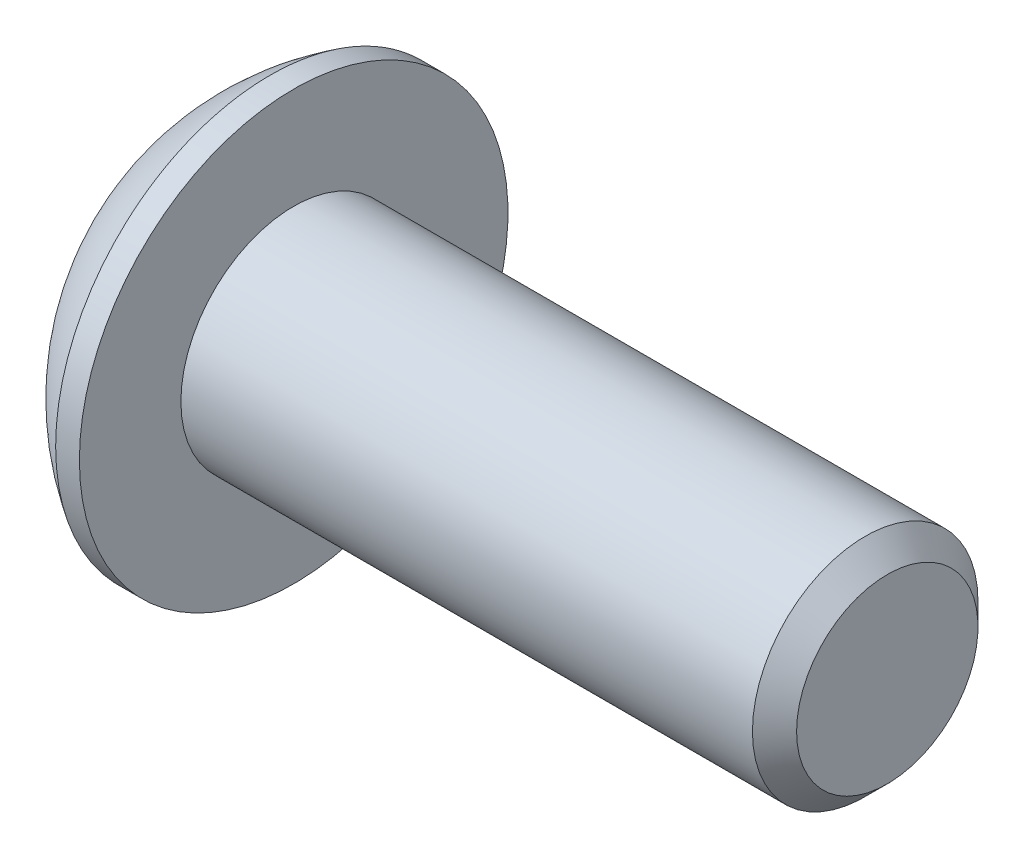
ISO-10303-21;
HEADER;
FILE_DESCRIPTION(('STEP AP214'),'2;1');
FILE_NAME('part.step','',(''),(''),'','','');
FILE_SCHEMA(('AUTOMOTIVE_DESIGN { 1 0 10303 214 1 1 1 1 }'));
ENDSEC;
DATA;
#1=APPLICATION_CONTEXT('core data for automotive mechanical design processes');
#2=APPLICATION_PROTOCOL_DEFINITION('international standard','automotive_design',2000,#1);
#3=PRODUCT_CONTEXT('',#1,'mechanical');
#4=PRODUCT('Part','Part','',(#3));
#5=PRODUCT_RELATED_PRODUCT_CATEGORY('part','',(#4));
#6=PRODUCT_DEFINITION_FORMATION('','',#4);
#7=PRODUCT_DEFINITION_CONTEXT('part definition',#1,'design');
#8=PRODUCT_DEFINITION('design','',#6,#7);
#9=PRODUCT_DEFINITION_SHAPE('','',#8);
#10=(LENGTH_UNIT() NAMED_UNIT(*) SI_UNIT(.MILLI.,.METRE.));
#11=(NAMED_UNIT(*) PLANE_ANGLE_UNIT() SI_UNIT($,.RADIAN.));
#12=(NAMED_UNIT(*) SI_UNIT($,.STERADIAN.) SOLID_ANGLE_UNIT());
#13=UNCERTAINTY_MEASURE_WITH_UNIT(LENGTH_MEASURE(1.E-05),#10,'distance_accuracy_value','');
#14=(GEOMETRIC_REPRESENTATION_CONTEXT(3) GLOBAL_UNCERTAINTY_ASSIGNED_CONTEXT((#13)) GLOBAL_UNIT_ASSIGNED_CONTEXT((#10,
#11,#12)) REPRESENTATION_CONTEXT('',''));
#15=CARTESIAN_POINT('',(0.,0.,0.));
#16=DIRECTION('',(0.,0.,1.));
#17=DIRECTION('',(1.,0.,0.));
#18=AXIS2_PLACEMENT_3D('',#15,#16,#17);
#19=CARTESIAN_POINT('',(1.77800000000017,0.,0.));
#20=DIRECTION('',(-1.,0.,0.));
#21=DIRECTION('',(0.,0.,1.));
#22=AXIS2_PLACEMENT_3D('',#19,#20,#21);
#23=CONICAL_SURFACE('',#22,1.58749999999985,1.04719755119662);
#24=CARTESIAN_POINT('',(2.69454355233856,0.,0.));
#25=VERTEX_POINT('',#24);
#26=VERTEX_LOOP('',#25);
#27=FACE_BOUND('',#26,.T.);
#28=CARTESIAN_POINT('',(1.77800000000017,0.,0.));
#29=DIRECTION('',(-1.,0.,0.));
#30=DIRECTION('',(0.,0.,1.));
#31=AXIS2_PLACEMENT_3D('',#28,#29,#30);
#32=CIRCLE('',#31,1.58749999999985);
#33=CARTESIAN_POINT('',(1.77800000000008,0.,1.58749999999993));
#34=VERTEX_POINT('',#33);
#35=CARTESIAN_POINT('',(1.77800000000008,-1.37481532850773,0.793749999999962));
#36=VERTEX_POINT('',#35);
#37=EDGE_CURVE('E20',#34,#36,#32,.F.);
#38=ORIENTED_EDGE('',*,*,#37,.F.);
#39=CARTESIAN_POINT('',(1.77800000000017,0.,0.));
#40=DIRECTION('',(-1.,0.,0.));
#41=DIRECTION('',(0.,0.,1.));
#42=AXIS2_PLACEMENT_3D('',#39,#40,#41);
#43=CIRCLE('',#42,1.58749999999985);
#44=CARTESIAN_POINT('',(1.77800000000008,1.37481532850773,0.793749999999964));
#45=VERTEX_POINT('',#44);
#46=EDGE_CURVE('E90',#34,#45,#43,.T.);
#47=ORIENTED_EDGE('',*,*,#46,.T.);
#48=CARTESIAN_POINT('',(1.77800000000017,0.,0.));
#49=DIRECTION('',(-1.,0.,0.));
#50=DIRECTION('',(0.,0.,1.));
#51=AXIS2_PLACEMENT_3D('',#48,#49,#50);
#52=CIRCLE('',#51,1.58749999999985);
#53=CARTESIAN_POINT('',(1.77800000000008,1.37481532850773,-0.793749999999964));
#54=VERTEX_POINT('',#53);
#55=EDGE_CURVE('E106',#45,#54,#52,.T.);
#56=ORIENTED_EDGE('',*,*,#55,.T.);
#57=CARTESIAN_POINT('',(1.77800000000017,0.,0.));
#58=DIRECTION('',(-1.,0.,0.));
#59=DIRECTION('',(0.,0.,1.));
#60=AXIS2_PLACEMENT_3D('',#57,#58,#59);
#61=CIRCLE('',#60,1.58749999999985);
#62=CARTESIAN_POINT('',(1.77800000000008,2.13833679173112E-12,-1.58749999999993));
#63=VERTEX_POINT('',#62);
#64=EDGE_CURVE('E449',#54,#63,#61,.T.);
#65=ORIENTED_EDGE('',*,*,#64,.T.);
#66=CARTESIAN_POINT('',(1.77800000000017,0.,0.));
#67=DIRECTION('',(-1.,0.,0.));
#68=DIRECTION('',(0.,0.,1.));
#69=AXIS2_PLACEMENT_3D('',#66,#67,#68);
#70=CIRCLE('',#69,1.58749999999985);
#71=CARTESIAN_POINT('',(1.77800000000008,-1.37481532850773,-0.793749999999963));
#72=VERTEX_POINT('',#71);
#73=EDGE_CURVE('E451',#72,#63,#70,.F.);
#74=ORIENTED_EDGE('',*,*,#73,.F.);
#75=CARTESIAN_POINT('',(1.77800000000017,0.,0.));
#76=DIRECTION('',(-1.,0.,0.));
#77=DIRECTION('',(0.,0.,1.));
#78=AXIS2_PLACEMENT_3D('',#75,#76,#77);
#79=CIRCLE('',#78,1.58749999999985);
#80=EDGE_CURVE('E93',#36,#72,#79,.F.);
#81=ORIENTED_EDGE('',*,*,#80,.F.);
#82=EDGE_LOOP('',(#38,#47,#56,#65,#74,#81));
#83=FACE_BOUND('',#82,.T.);
#84=ADVANCED_FACE('F17',(#27,#83),#23,.F.);
#85=CARTESIAN_POINT('',(1.778,-2.74963065701559,-1.5875));
#86=DIRECTION('',(1.,0.,0.));
#87=DIRECTION('',(0.,0.,-1.));
#88=AXIS2_PLACEMENT_3D('',#85,#86,#87);
#89=PLANE('',#88);
#90=DIRECTION('',(0.,0.5,0.866025403784439));
#91=VECTOR('',#90,1.);
#92=CARTESIAN_POINT('',(1.778,-1.83308710467706,0.));
#93=LINE('',#92,#91);
#94=CARTESIAN_POINT('',(1.778,-0.916543552338531,1.5875));
#95=VERTEX_POINT('',#94);
#96=EDGE_CURVE('E111',#95,#36,#93,.F.);
#97=ORIENTED_EDGE('',*,*,#96,.F.);
#98=DIRECTION('',(0.,1.,0.));
#99=VECTOR('',#98,1.);
#100=CARTESIAN_POINT('',(1.778,-0.916543552338531,1.5875));
#101=LINE('',#100,#99);
#102=EDGE_CURVE('E109',#34,#95,#101,.F.);
#103=ORIENTED_EDGE('',*,*,#102,.F.);
#104=ORIENTED_EDGE('',*,*,#37,.T.);
#105=EDGE_LOOP('',(#97,#103,#104));
#106=FACE_BOUND('',#105,.T.);
#107=ADVANCED_FACE('F110',(#106),#89,.F.);
#108=CARTESIAN_POINT('',(1.778,-2.74963065701559,-1.5875));
#109=DIRECTION('',(1.,0.,0.));
#110=DIRECTION('',(0.,0.,-1.));
#111=AXIS2_PLACEMENT_3D('',#108,#109,#110);
#112=PLANE('',#111);
#113=DIRECTION('',(0.,-0.5,0.866025403784439));
#114=VECTOR('',#113,1.);
#115=CARTESIAN_POINT('',(1.778,-0.916543552338531,-1.5875));
#116=LINE('',#115,#114);
#117=CARTESIAN_POINT('',(1.778,-1.83308710467706,0.));
#118=VERTEX_POINT('',#117);
#119=EDGE_CURVE('E159',#118,#72,#116,.F.);
#120=ORIENTED_EDGE('',*,*,#119,.F.);
#121=DIRECTION('',(0.,0.5,0.866025403784439));
#122=VECTOR('',#121,1.);
#123=CARTESIAN_POINT('',(1.778,-1.83308710467706,0.));
#124=LINE('',#123,#122);
#125=EDGE_CURVE('E171',#36,#118,#124,.F.);
#126=ORIENTED_EDGE('',*,*,#125,.F.);
#127=ORIENTED_EDGE('',*,*,#80,.T.);
#128=EDGE_LOOP('',(#120,#126,#127));
#129=FACE_BOUND('',#128,.T.);
#130=ADVANCED_FACE('F248',(#129),#112,.F.);
#131=CARTESIAN_POINT('',(1.778,-2.74963065701559,-1.5875));
#132=DIRECTION('',(1.,0.,0.));
#133=DIRECTION('',(0.,0.,-1.));
#134=AXIS2_PLACEMENT_3D('',#131,#132,#133);
#135=PLANE('',#134);
#136=DIRECTION('',(0.,1.,0.));
#137=VECTOR('',#136,1.);
#138=CARTESIAN_POINT('',(1.778,0.916543552338531,-1.5875));
#139=LINE('',#138,#137);
#140=CARTESIAN_POINT('',(1.778,-0.916543552338531,-1.5875));
#141=VERTEX_POINT('',#140);
#142=EDGE_CURVE('E143',#141,#63,#139,.T.);
#143=ORIENTED_EDGE('',*,*,#142,.F.);
#144=DIRECTION('',(0.,-0.5,0.866025403784439));
#145=VECTOR('',#144,1.);
#146=CARTESIAN_POINT('',(1.778,-0.916543552338531,-1.5875));
#147=LINE('',#146,#145);
#148=EDGE_CURVE('E156',#72,#141,#147,.F.);
#149=ORIENTED_EDGE('',*,*,#148,.F.);
#150=ORIENTED_EDGE('',*,*,#73,.T.);
#151=EDGE_LOOP('',(#143,#149,#150));
#152=FACE_BOUND('',#151,.T.);
#153=ADVANCED_FACE('F244',(#152),#135,.F.);
#154=CARTESIAN_POINT('',(1.778,-2.74963065701559,-1.5875));
#155=DIRECTION('',(1.,0.,0.));
#156=DIRECTION('',(0.,0.,-1.));
#157=AXIS2_PLACEMENT_3D('',#154,#155,#156);
#158=PLANE('',#157);
#159=DIRECTION('',(0.,-0.500000000000001,-0.866025403784438));
#160=VECTOR('',#159,1.);
#161=CARTESIAN_POINT('',(1.778,1.83308710467706,0.));
#162=LINE('',#161,#160);
#163=CARTESIAN_POINT('',(1.778,0.91654355233853,-1.5875));
#164=VERTEX_POINT('',#163);
#165=EDGE_CURVE('E128',#164,#54,#162,.F.);
#166=ORIENTED_EDGE('',*,*,#165,.F.);
#167=DIRECTION('',(0.,1.,0.));
#168=VECTOR('',#167,1.);
#169=CARTESIAN_POINT('',(1.778,0.916543552338531,-1.5875));
#170=LINE('',#169,#168);
#171=EDGE_CURVE('E140',#63,#164,#170,.T.);
#172=ORIENTED_EDGE('',*,*,#171,.F.);
#173=ORIENTED_EDGE('',*,*,#64,.F.);
#174=EDGE_LOOP('',(#166,#172,#173));
#175=FACE_BOUND('',#174,.T.);
#176=ADVANCED_FACE('F240',(#175),#158,.F.);
#177=CARTESIAN_POINT('',(1.778,-2.74963065701559,-1.5875));
#178=DIRECTION('',(1.,0.,0.));
#179=DIRECTION('',(0.,0.,-1.));
#180=AXIS2_PLACEMENT_3D('',#177,#178,#179);
#181=PLANE('',#180);
#182=DIRECTION('',(0.,0.5,-0.866025403784438));
#183=VECTOR('',#182,1.);
#184=CARTESIAN_POINT('',(1.778,0.916543552338531,1.5875));
#185=LINE('',#184,#183);
#186=CARTESIAN_POINT('',(1.778,1.83308710467706,0.));
#187=VERTEX_POINT('',#186);
#188=EDGE_CURVE('E148',#187,#45,#185,.F.);
#189=ORIENTED_EDGE('',*,*,#188,.F.);
#190=DIRECTION('',(0.,-0.500000000000001,-0.866025403784438));
#191=VECTOR('',#190,1.);
#192=CARTESIAN_POINT('',(1.778,1.83308710467706,0.));
#193=LINE('',#192,#191);
#194=EDGE_CURVE('E125',#54,#187,#193,.F.);
#195=ORIENTED_EDGE('',*,*,#194,.F.);
#196=ORIENTED_EDGE('',*,*,#55,.F.);
#197=EDGE_LOOP('',(#189,#195,#196));
#198=FACE_BOUND('',#197,.T.);
#199=ADVANCED_FACE('F237',(#198),#181,.F.);
#200=CARTESIAN_POINT('',(1.778,-2.74963065701559,-1.5875));
#201=DIRECTION('',(1.,0.,0.));
#202=DIRECTION('',(0.,0.,-1.));
#203=AXIS2_PLACEMENT_3D('',#200,#201,#202);
#204=PLANE('',#203);
#205=DIRECTION('',(0.,1.,0.));
#206=VECTOR('',#205,1.);
#207=CARTESIAN_POINT('',(1.778,-0.916543552338531,1.5875));
#208=LINE('',#207,#206);
#209=CARTESIAN_POINT('',(1.778,0.916543552338531,1.5875));
#210=VERTEX_POINT('',#209);
#211=EDGE_CURVE('E101',#210,#34,#208,.F.);
#212=ORIENTED_EDGE('',*,*,#211,.F.);
#213=DIRECTION('',(0.,0.5,-0.866025403784438));
#214=VECTOR('',#213,1.);
#215=CARTESIAN_POINT('',(1.778,0.916543552338531,1.5875));
#216=LINE('',#215,#214);
#217=EDGE_CURVE('E104',#45,#210,#216,.F.);
#218=ORIENTED_EDGE('',*,*,#217,.F.);
#219=ORIENTED_EDGE('',*,*,#46,.F.);
#220=EDGE_LOOP('',(#212,#218,#219));
#221=FACE_BOUND('',#220,.T.);
#222=ADVANCED_FACE('F99',(#221),#204,.F.);
#223=CARTESIAN_POINT('',(1.778,-0.916543552338531,1.5875));
#224=DIRECTION('',(0.,0.,-1.));
#225=DIRECTION('',(0.,1.,0.));
#226=AXIS2_PLACEMENT_3D('',#223,#224,#225);
#227=PLANE('',#226);
#228=DIRECTION('',(0.,1.,0.));
#229=VECTOR('',#228,1.);
#230=CARTESIAN_POINT('',(0.,0.,1.5875));
#231=LINE('',#230,#229);
#232=CARTESIAN_POINT('',(0.,0.916543552338531,1.5875));
#233=VERTEX_POINT('',#232);
#234=CARTESIAN_POINT('',(0.,-0.916543552338531,1.5875));
#235=VERTEX_POINT('',#234);
#236=EDGE_CURVE('E132',#233,#235,#231,.F.);
#237=ORIENTED_EDGE('',*,*,#236,.F.);
#238=DIRECTION('',(1.,0.,0.));
#239=VECTOR('',#238,1.);
#240=CARTESIAN_POINT('',(1.778,0.916543552338531,1.5875));
#241=LINE('',#240,#239);
#242=EDGE_CURVE('E117',#210,#233,#241,.F.);
#243=ORIENTED_EDGE('',*,*,#242,.F.);
#244=ORIENTED_EDGE('',*,*,#211,.T.);
#245=ORIENTED_EDGE('',*,*,#102,.T.);
#246=DIRECTION('',(1.,0.,0.));
#247=VECTOR('',#246,1.);
#248=CARTESIAN_POINT('',(1.778,-0.916543552338531,1.5875));
#249=LINE('',#248,#247);
#250=EDGE_CURVE('E168',#235,#95,#249,.T.);
#251=ORIENTED_EDGE('',*,*,#250,.F.);
#252=EDGE_LOOP('',(#237,#243,#244,#245,#251));
#253=FACE_BOUND('',#252,.T.);
#254=ADVANCED_FACE('F115',(#253),#227,.T.);
#255=CARTESIAN_POINT('',(1.778,-1.83308710467706,0.));
#256=DIRECTION('',(0.,0.866025403784439,-0.5));
#257=DIRECTION('',(0.,0.5,0.866025403784439));
#258=AXIS2_PLACEMENT_3D('',#255,#256,#257);
#259=PLANE('',#258);
#260=DIRECTION('',(0.,-0.5,-0.866025403784439));
#261=VECTOR('',#260,1.);
#262=CARTESIAN_POINT('',(0.,-0.916543552338531,1.5875));
#263=LINE('',#262,#261);
#264=CARTESIAN_POINT('',(0.,-1.83308710467706,0.));
#265=VERTEX_POINT('',#264);
#266=EDGE_CURVE('E435',#235,#265,#263,.T.);
#267=ORIENTED_EDGE('',*,*,#266,.F.);
#268=ORIENTED_EDGE('',*,*,#250,.T.);
#269=ORIENTED_EDGE('',*,*,#96,.T.);
#270=ORIENTED_EDGE('',*,*,#125,.T.);
#271=DIRECTION('',(1.,0.,0.));
#272=VECTOR('',#271,1.);
#273=CARTESIAN_POINT('',(1.778,-1.83308710467706,0.));
#274=LINE('',#273,#272);
#275=EDGE_CURVE('E153',#265,#118,#274,.T.);
#276=ORIENTED_EDGE('',*,*,#275,.F.);
#277=EDGE_LOOP('',(#267,#268,#269,#270,#276));
#278=FACE_BOUND('',#277,.T.);
#279=ADVANCED_FACE('F228',(#278),#259,.T.);
#280=CARTESIAN_POINT('',(1.778,-0.916543552338531,-1.5875));
#281=DIRECTION('',(0.,0.866025403784439,0.5));
#282=DIRECTION('',(0.,-0.5,0.866025403784439));
#283=AXIS2_PLACEMENT_3D('',#280,#281,#282);
#284=PLANE('',#283);
#285=DIRECTION('',(0.,0.5,-0.866025403784439));
#286=VECTOR('',#285,1.);
#287=CARTESIAN_POINT('',(0.,-1.83308710467706,0.));
#288=LINE('',#287,#286);
#289=CARTESIAN_POINT('',(0.,-0.916543552338531,-1.5875));
#290=VERTEX_POINT('',#289);
#291=EDGE_CURVE('E432',#265,#290,#288,.T.);
#292=ORIENTED_EDGE('',*,*,#291,.F.);
#293=ORIENTED_EDGE('',*,*,#275,.T.);
#294=ORIENTED_EDGE('',*,*,#119,.T.);
#295=ORIENTED_EDGE('',*,*,#148,.T.);
#296=DIRECTION('',(1.,0.,0.));
#297=VECTOR('',#296,1.);
#298=CARTESIAN_POINT('',(1.778,-0.916543552338531,-1.5875));
#299=LINE('',#298,#297);
#300=EDGE_CURVE('E137',#290,#141,#299,.T.);
#301=ORIENTED_EDGE('',*,*,#300,.F.);
#302=EDGE_LOOP('',(#292,#293,#294,#295,#301));
#303=FACE_BOUND('',#302,.T.);
#304=ADVANCED_FACE('F224',(#303),#284,.T.);
#305=CARTESIAN_POINT('',(1.778,0.916543552338531,-1.5875));
#306=DIRECTION('',(0.,0.,1.));
#307=DIRECTION('',(1.,0.,0.));
#308=AXIS2_PLACEMENT_3D('',#305,#306,#307);
#309=PLANE('',#308);
#310=DIRECTION('',(0.,1.,0.));
#311=VECTOR('',#310,1.);
#312=CARTESIAN_POINT('',(0.,0.,-1.5875));
#313=LINE('',#312,#311);
#314=CARTESIAN_POINT('',(0.,0.91654355233853,-1.5875));
#315=VERTEX_POINT('',#314);
#316=EDGE_CURVE('E429',#290,#315,#313,.T.);
#317=ORIENTED_EDGE('',*,*,#316,.F.);
#318=ORIENTED_EDGE('',*,*,#300,.T.);
#319=ORIENTED_EDGE('',*,*,#142,.T.);
#320=ORIENTED_EDGE('',*,*,#171,.T.);
#321=DIRECTION('',(1.,0.,0.));
#322=VECTOR('',#321,1.);
#323=CARTESIAN_POINT('',(1.778,0.91654355233853,-1.5875));
#324=LINE('',#323,#322);
#325=EDGE_CURVE('E127',#315,#164,#324,.T.);
#326=ORIENTED_EDGE('',*,*,#325,.F.);
#327=EDGE_LOOP('',(#317,#318,#319,#320,#326));
#328=FACE_BOUND('',#327,.T.);
#329=ADVANCED_FACE('F221',(#328),#309,.T.);
#330=CARTESIAN_POINT('',(1.778,1.83308710467706,0.));
#331=DIRECTION('',(0.,-0.866025403784438,0.500000000000001));
#332=DIRECTION('',(0.,-0.500000000000001,-0.866025403784438));
#333=AXIS2_PLACEMENT_3D('',#330,#331,#332);
#334=PLANE('',#333);
#335=DIRECTION('',(0.,0.500000000000001,0.866025403784438));
#336=VECTOR('',#335,1.);
#337=CARTESIAN_POINT('',(0.,0.916543552338531,-1.5875));
#338=LINE('',#337,#336);
#339=CARTESIAN_POINT('',(0.,1.83308710467706,0.));
#340=VERTEX_POINT('',#339);
#341=EDGE_CURVE('E426',#315,#340,#338,.T.);
#342=ORIENTED_EDGE('',*,*,#341,.F.);
#343=ORIENTED_EDGE('',*,*,#325,.T.);
#344=ORIENTED_EDGE('',*,*,#165,.T.);
#345=ORIENTED_EDGE('',*,*,#194,.T.);
#346=DIRECTION('',(1.,0.,0.));
#347=VECTOR('',#346,1.);
#348=CARTESIAN_POINT('',(1.778,1.83308710467706,0.));
#349=LINE('',#348,#347);
#350=EDGE_CURVE('E35',#340,#187,#349,.T.);
#351=ORIENTED_EDGE('',*,*,#350,.F.);
#352=EDGE_LOOP('',(#342,#343,#344,#345,#351));
#353=FACE_BOUND('',#352,.T.);
#354=ADVANCED_FACE('F217',(#353),#334,.T.);
#355=CARTESIAN_POINT('',(1.778,0.916543552338531,1.5875));
#356=DIRECTION('',(0.,-0.866025403784438,-0.5));
#357=DIRECTION('',(0.,0.5,-0.866025403784438));
#358=AXIS2_PLACEMENT_3D('',#355,#356,#357);
#359=PLANE('',#358);
#360=DIRECTION('',(0.,-0.5,0.866025403784438));
#361=VECTOR('',#360,1.);
#362=CARTESIAN_POINT('',(0.,1.83308710467706,0.));
#363=LINE('',#362,#361);
#364=EDGE_CURVE('E203',#340,#233,#363,.T.);
#365=ORIENTED_EDGE('',*,*,#364,.F.);
#366=ORIENTED_EDGE('',*,*,#350,.T.);
#367=ORIENTED_EDGE('',*,*,#188,.T.);
#368=ORIENTED_EDGE('',*,*,#217,.T.);
#369=ORIENTED_EDGE('',*,*,#242,.T.);
#370=EDGE_LOOP('',(#365,#366,#367,#368,#369));
#371=FACE_BOUND('',#370,.T.);
#372=ADVANCED_FACE('F213',(#371),#359,.T.);
#373=CARTESIAN_POINT('',(0.,0.,0.));
#374=DIRECTION('',(-1.,0.,0.));
#375=DIRECTION('',(0.,0.,1.));
#376=AXIS2_PLACEMENT_3D('',#373,#374,#375);
#377=PLANE('',#376);
#378=ORIENTED_EDGE('',*,*,#341,.T.);
#379=ORIENTED_EDGE('',*,*,#364,.T.);
#380=ORIENTED_EDGE('',*,*,#236,.T.);
#381=ORIENTED_EDGE('',*,*,#266,.T.);
#382=ORIENTED_EDGE('',*,*,#291,.T.);
#383=ORIENTED_EDGE('',*,*,#316,.T.);
#384=EDGE_LOOP('',(#378,#379,#380,#381,#382,#383));
#385=FACE_BOUND('',#384,.T.);
#386=CARTESIAN_POINT('',(0.,2.29235,0.));
#387=CARTESIAN_POINT('',(0.,2.29234961429956,0.0643619991867153));
#388=CARTESIAN_POINT('',(0.,2.28963695190107,0.128735826629365));
#389=CARTESIAN_POINT('',(0.,2.27880393843647,0.257038618985285));
#390=CARTESIAN_POINT('',(0.,2.27068199085126,0.320967446929161));
#391=CARTESIAN_POINT('',(0.,2.24906694794255,0.448021254607715));
#392=CARTESIAN_POINT('',(-2.10824184437212E-13,2.2355653265346,0.511144793381859));
#393=CARTESIAN_POINT('',(2.11863340668574E-13,2.20328400495643,0.636065176149319));
#394=CARTESIAN_POINT('',(7.898583416728E-13,2.18450002159113,0.697860899533932));
#395=CARTESIAN_POINT('',(1.31296954862567E-12,2.12048422735802,0.880329802927745));
#396=CARTESIAN_POINT('',(0.,2.06753599079458,0.998391795928112));
#397=CARTESIAN_POINT('',(0.,1.94254204858672,1.22393765942147));
#398=CARTESIAN_POINT('',(1.09188685833251E-12,1.87049561696642,1.33142112758208));
#399=CARTESIAN_POINT('',(6.7685541846695E-13,1.7497425419488,1.48237719670934));
#400=CARTESIAN_POINT('',(1.81629011781581E-13,1.707345731323,1.53101280076737));
#401=CARTESIAN_POINT('',(-1.80586950453791E-13,1.61863910291528,1.62450601319185));
#402=CARTESIAN_POINT('',(0.,1.57233309727312,1.66936721890417));
#403=CARTESIAN_POINT('',(0.,1.47608431707233,1.7550488420402));
#404=CARTESIAN_POINT('',(0.,1.42613990458994,1.79586741981511));
#405=CARTESIAN_POINT('',(0.,1.3229945254125,1.87315615311522));
#406=CARTESIAN_POINT('',(0.,1.26979280714187,1.90962529930696));
#407=CARTESIAN_POINT('',(0.,1.10588180153952,2.01207722151089));
#408=CARTESIAN_POINT('',(0.,0.990764947001308,2.07119486286666));
#409=CARTESIAN_POINT('',(0.,0.752302198839715,2.16922858468856));
#410=CARTESIAN_POINT('',(0.,0.628956393121258,2.20814488091449));
#411=CARTESIAN_POINT('',(0.,0.377466101733267,2.26472755765919));
#412=CARTESIAN_POINT('',(0.,0.249321590440378,2.28239382469378));
#413=CARTESIAN_POINT('',(0.,-0.00811435371610919,2.29595665980955));
#414=CARTESIAN_POINT('',(0.,-0.137405786579707,2.29185322789072));
#415=CARTESIAN_POINT('',(0.,-0.393449386933728,2.2620096240906));
#416=CARTESIAN_POINT('',(0.,-0.520201567981086,2.23626956775766));
#417=CARTESIAN_POINT('',(0.,-0.767645294384453,2.16383549332687));
#418=CARTESIAN_POINT('',(0.,-0.888336774993558,2.11714125142685));
#419=CARTESIAN_POINT('',(0.,-1.06210572146656,2.03247976453653));
#420=CARTESIAN_POINT('',(0.,-1.11884498714067,2.00180278323695));
#421=CARTESIAN_POINT('',(0.,-1.22954062855573,1.93578011658035));
#422=CARTESIAN_POINT('',(0.,-1.28349764565393,1.9004355139425));
#423=CARTESIAN_POINT('',(0.,-1.38821676641538,1.82534174602348));
#424=CARTESIAN_POINT('',(0.,-1.43898030563029,1.78559458231503));
#425=CARTESIAN_POINT('',(0.,-1.53701984534431,1.70193996292361));
#426=CARTESIAN_POINT('',(0.,-1.58429243280551,1.65802852924126));
#427=CARTESIAN_POINT('',(0.,-1.72023903553758,1.52059650554138));
#428=CARTESIAN_POINT('',(0.,-1.80318066138239,1.42127847626519));
#429=CARTESIAN_POINT('',(0.,-1.95118232345099,1.21011519784664));
#430=CARTESIAN_POINT('',(0.,-2.01624303935585,1.09827042509272));
#431=CARTESIAN_POINT('',(0.,-2.09907772661315,0.92353823800584));
#432=CARTESIAN_POINT('',(0.,-2.12425103063559,0.864058373981967));
#433=CARTESIAN_POINT('',(0.,-2.16947990046566,0.743221562175602));
#434=CARTESIAN_POINT('',(0.,-2.18953960800684,0.681866178863367));
#435=CARTESIAN_POINT('',(0.,-2.22438542051156,0.55778697240036));
#436=CARTESIAN_POINT('',(0.,-2.23917985294819,0.495065478128176));
#437=CARTESIAN_POINT('',(0.,-2.26343456384454,0.368611258323519));
#438=CARTESIAN_POINT('',(0.,-2.27289641559286,0.304878836759572));
#439=CARTESIAN_POINT('',(0.,-2.28388649696737,0.200873029360627));
#440=CARTESIAN_POINT('',(0.,-2.28705930623294,0.1607661641801));
#441=CARTESIAN_POINT('',(0.,-2.29129117827045,0.0804410725432722));
#442=CARTESIAN_POINT('',(0.,-2.29235024104239,0.0402228460869721));
#443=CARTESIAN_POINT('',(0.,-2.29234961429957,-0.0643619991867166));
#444=CARTESIAN_POINT('',(0.,-2.28963695190108,-0.128735826629366));
#445=CARTESIAN_POINT('',(0.,-2.27880393843648,-0.257038618985286));
#446=CARTESIAN_POINT('',(0.,-2.27068199085127,-0.320967446929162));
#447=CARTESIAN_POINT('',(0.,-2.24906694794256,-0.448021254607716));
#448=CARTESIAN_POINT('',(-2.10791682211012E-13,-2.23556532653461,-0.51114479338186));
#449=CARTESIAN_POINT('',(2.11830812011626E-13,-2.20328400495644,-0.63606517614932));
#450=CARTESIAN_POINT('',(7.89900352979323E-13,-2.18450002159114,-0.697860899533933));
#451=CARTESIAN_POINT('',(1.31288572627556E-12,-2.12048422735803,-0.880329802927746));
#452=CARTESIAN_POINT('',(0.,-2.06753599079459,-0.998391795928114));
#453=CARTESIAN_POINT('',(0.,-1.94254204858673,-1.22393765942147));
#454=CARTESIAN_POINT('',(1.09432969402769E-12,-1.87049561696643,-1.33142112758208));
#455=CARTESIAN_POINT('',(6.78235621887555E-13,-1.74974254194881,-1.48237719670935));
#456=CARTESIAN_POINT('',(1.82023220003121E-13,-1.70734573132301,-1.53101280076737));
#457=CARTESIAN_POINT('',(-1.80980778599231E-13,-1.61863910291529,-1.62450601319185));
#458=CARTESIAN_POINT('',(0.,-1.57233309727313,-1.66936721890417));
#459=CARTESIAN_POINT('',(0.,-1.47608431707234,-1.7550488420402));
#460=CARTESIAN_POINT('',(0.,-1.42613990458995,-1.79586741981511));
#461=CARTESIAN_POINT('',(0.,-1.32299452541251,-1.87315615311522));
#462=CARTESIAN_POINT('',(0.,-1.26979280714188,-1.90962529930696));
#463=CARTESIAN_POINT('',(0.,-1.10588180153953,-2.01207722151089));
#464=CARTESIAN_POINT('',(0.,-0.990764947001315,-2.07119486286666));
#465=CARTESIAN_POINT('',(0.,-0.752302198839722,-2.16922858468855));
#466=CARTESIAN_POINT('',(0.,-0.628956393121265,-2.20814488091449));
#467=CARTESIAN_POINT('',(0.,-0.377466101733275,-2.26472755765919));
#468=CARTESIAN_POINT('',(0.,-0.249321590440386,-2.28239382469378));
#469=CARTESIAN_POINT('',(0.,0.00811435371609967,-2.29595665980955));
#470=CARTESIAN_POINT('',(0.,0.137405786579697,-2.29185322789072));
#471=CARTESIAN_POINT('',(0.,0.393449386933717,-2.2620096240906));
#472=CARTESIAN_POINT('',(0.,0.520201567981075,-2.23626956775766));
#473=CARTESIAN_POINT('',(0.,0.767645294384443,-2.16383549332687));
#474=CARTESIAN_POINT('',(0.,0.888336774993549,-2.11714125142686));
#475=CARTESIAN_POINT('',(0.,1.06210572146655,-2.03247976453654));
#476=CARTESIAN_POINT('',(0.,1.11884498714066,-2.00180278323695));
#477=CARTESIAN_POINT('',(0.,1.22954062855572,-1.93578011658035));
#478=CARTESIAN_POINT('',(0.,1.28349764565392,-1.9004355139425));
#479=CARTESIAN_POINT('',(0.,1.38821676641537,-1.82534174602348));
#480=CARTESIAN_POINT('',(0.,1.43898030563028,-1.78559458231503));
#481=CARTESIAN_POINT('',(0.,1.53701984534431,-1.70193996292362));
#482=CARTESIAN_POINT('',(0.,1.5842924328055,-1.65802852924127));
#483=CARTESIAN_POINT('',(0.,1.72023903553758,-1.52059650554139));
#484=CARTESIAN_POINT('',(0.,1.80318066138238,-1.42127847626519));
#485=CARTESIAN_POINT('',(0.,1.95118232345098,-1.21011519784664));
#486=CARTESIAN_POINT('',(0.,2.01624303935584,-1.09827042509272));
#487=CARTESIAN_POINT('',(0.,2.09907772661314,-0.923538238005841));
#488=CARTESIAN_POINT('',(0.,2.12425103063558,-0.864058373981969));
#489=CARTESIAN_POINT('',(0.,2.16947990046565,-0.743221562175604));
#490=CARTESIAN_POINT('',(0.,2.18953960800683,-0.681866178863368));
#491=CARTESIAN_POINT('',(0.,2.22438542051155,-0.55778697240036));
#492=CARTESIAN_POINT('',(0.,2.23917985294818,-0.495065478128176));
#493=CARTESIAN_POINT('',(0.,2.26343456384453,-0.368611258323519));
#494=CARTESIAN_POINT('',(0.,2.27289641559285,-0.304878836759573));
#495=CARTESIAN_POINT('',(0.,2.28388649696736,-0.200873029360628));
#496=CARTESIAN_POINT('',(0.,2.28705930623293,-0.160766164180101));
#497=CARTESIAN_POINT('',(0.,2.29129117827044,-0.0804410725432734));
#498=CARTESIAN_POINT('',(0.,2.29235024104238,-0.0402228460869733));
#499=CARTESIAN_POINT('',(0.,2.29235,0.));
#500=B_SPLINE_CURVE_WITH_KNOTS('',3,(#386,#387,#388,#389,#390,#391,#392,#393,#394,#395,#396,
#397,#398,#399,#400,#401,#402,#403,#404,#405,#406,#407,#408,#409,#410,#411,#412,#413,#414,#415,
#416,#417,#418,#419,#420,#421,#422,#423,#424,#425,#426,#427,#428,#429,#430,#431,#432,#433,#434,
#435,#436,#437,#438,#439,#440,#441,#442,#443,#444,#445,#446,#447,#448,#449,#450,#451,#452,#453,
#454,#455,#456,#457,#458,#459,#460,#461,#462,#463,#464,#465,#466,#467,#468,#469,#470,#471,#472,
#473,#474,#475,#476,#477,#478,#479,#480,#481,#482,#483,#484,#485,#486,#487,#488,#489,#490,#491,
#492,#493,#494,#495,#496,#497,#498,#499),.UNSPECIFIED.,.T.,.F.,(4,2,2,2,2,2,2,2,2,2,2,2,2,2,2,2,
2,2,2,2,2,2,2,2,2,2,2,2,2,2,2,2,2,2,2,2,2,2,2,2,2,2,2,2,2,2,2,2,2,2,2,2,2,2,2,2,4),(0.,
0.193048968618032,0.386154939782393,0.579568183995957,0.773138711491036,1.15935703864577,
1.54559004914644,1.73895960916368,1.93214273180063,2.12541336477221,2.31872876140888,
2.70495649282618,3.09118009906582,3.47740576789431,3.86363143672284,4.24985504296253,
4.63608277437979,4.82939817101619,5.02266880398747,5.21585192662419,5.40922148664121,
5.79545449714216,6.18167282429724,6.3752433517926,6.5686565960064,6.76176256717088,
6.95481153578907,7.07545693291921,7.19610233004936,7.38915129866739,7.58225726983176,
7.77567051404532,7.9692410415404,8.35545936869513,8.74169237919581,8.93506193921304,
9.12824506184999,9.32151569482157,9.51483109145824,9.90105882287554,10.2872824291152,
10.6735080979437,11.0597337667722,11.4459573730119,11.8321851044291,12.0255005010656,
12.2187711340368,12.4119542566736,12.6053238166906,12.9915568271915,13.3777751543466,
13.571345681842,13.7647589260558,13.9578648972202,14.1509138658384,14.2715592629686,
14.3922046600987),.UNSPECIFIED.);
#501=CARTESIAN_POINT('',(0.,2.29235,0.));
#502=VERTEX_POINT('',#501);
#503=EDGE_CURVE('E197',#502,#502,#500,.T.);
#504=ORIENTED_EDGE('',*,*,#503,.F.);
#505=EDGE_LOOP('',(#504));
#506=FACE_BOUND('',#505,.T.);
#507=ADVANCED_FACE('F209',(#385,#506),#377,.T.);
#508=CARTESIAN_POINT('',(4.85989606481482,0.,0.));
#509=DIRECTION('',(0.,1.,0.));
#510=DIRECTION('',(1.,0.,0.));
#511=AXIS2_PLACEMENT_3D('',#508,#509,#510);
#512=SPHERICAL_SURFACE('',#511,5.37340285883188);
#513=CARTESIAN_POINT('',(2.0574,0.,0.));
#514=DIRECTION('',(-1.,0.,0.));
#515=DIRECTION('',(0.,0.,1.));
#516=AXIS2_PLACEMENT_3D('',#513,#514,#515);
#517=CIRCLE('',#516,4.5847);
#518=CARTESIAN_POINT('',(2.0574,0.,4.5847));
#519=VERTEX_POINT('',#518);
#520=EDGE_CURVE('E194',#519,#519,#517,.F.);
#521=ORIENTED_EDGE('',*,*,#520,.F.);
#522=EDGE_LOOP('',(#521));
#523=FACE_BOUND('',#522,.T.);
#524=ORIENTED_EDGE('',*,*,#503,.T.);
#525=EDGE_LOOP('',(#524));
#526=FACE_BOUND('',#525,.T.);
#527=ADVANCED_FACE('F205',(#523,#526),#512,.T.);
#528=CARTESIAN_POINT('',(15.2654,0.,0.));
#529=DIRECTION('',(-1.,0.,0.));
#530=DIRECTION('',(0.,0.,1.));
#531=AXIS2_PLACEMENT_3D('',#528,#529,#530);
#532=PLANE('',#531);
#533=CARTESIAN_POINT('',(15.2653999999757,0.,0.));
#534=DIRECTION('',(-1.,0.,0.));
#535=DIRECTION('',(0.,0.,1.));
#536=AXIS2_PLACEMENT_3D('',#533,#534,#535);
#537=CIRCLE('',#536,1.94055999992315);
#538=CARTESIAN_POINT('',(15.2653999999757,0.,1.94055999992315));
#539=VERTEX_POINT('',#538);
#540=EDGE_CURVE('E191',#539,#539,#537,.T.);
#541=ORIENTED_EDGE('',*,*,#540,.F.);
#542=EDGE_LOOP('',(#541));
#543=FACE_BOUND('',#542,.T.);
#544=ADVANCED_FACE('F276',(#543),#532,.F.);
#545=CARTESIAN_POINT('',(0.,0.,0.));
#546=DIRECTION('',(-1.,0.,0.));
#547=DIRECTION('',(0.,0.,1.));
#548=AXIS2_PLACEMENT_3D('',#545,#546,#547);
#549=CYLINDRICAL_SURFACE('',#548,4.5847);
#550=ORIENTED_EDGE('',*,*,#520,.T.);
#551=EDGE_LOOP('',(#550));
#552=FACE_BOUND('',#551,.T.);
#553=CARTESIAN_POINT('',(2.5654,0.,0.));
#554=DIRECTION('',(-1.,0.,0.));
#555=DIRECTION('',(0.,0.,1.));
#556=AXIS2_PLACEMENT_3D('',#553,#554,#555);
#557=CIRCLE('',#556,4.5847);
#558=CARTESIAN_POINT('',(2.5654,0.,4.5847));
#559=VERTEX_POINT('',#558);
#560=EDGE_CURVE('E188',#559,#559,#557,.T.);
#561=ORIENTED_EDGE('',*,*,#560,.T.);
#562=EDGE_LOOP('',(#561));
#563=FACE_BOUND('',#562,.T.);
#564=ADVANCED_FACE('F273',(#552,#563),#549,.T.);
#565=CARTESIAN_POINT('',(14.7929599999088,0.,0.));
#566=DIRECTION('',(-1.,0.,0.));
#567=DIRECTION('',(0.,0.,1.));
#568=AXIS2_PLACEMENT_3D('',#565,#566,#567);
#569=CONICAL_SURFACE('',#568,2.41299999999001,0.785398163397448);
#570=CARTESIAN_POINT('',(14.79296,0.,0.));
#571=DIRECTION('',(-1.,0.,0.));
#572=DIRECTION('',(0.,0.,1.));
#573=AXIS2_PLACEMENT_3D('',#570,#571,#572);
#574=CIRCLE('',#573,2.41299999999999);
#575=CARTESIAN_POINT('',(14.79296,0.,2.41299999999999));
#576=VERTEX_POINT('',#575);
#577=EDGE_CURVE('E26',#576,#576,#574,.T.);
#578=ORIENTED_EDGE('',*,*,#577,.F.);
#579=EDGE_LOOP('',(#578));
#580=FACE_BOUND('',#579,.T.);
#581=ORIENTED_EDGE('',*,*,#540,.T.);
#582=EDGE_LOOP('',(#581));
#583=FACE_BOUND('',#582,.T.);
#584=ADVANCED_FACE('F266',(#580,#583),#569,.T.);
#585=CARTESIAN_POINT('',(2.5654,2.41299999999999,0.));
#586=DIRECTION('',(-1.,0.,0.));
#587=DIRECTION('',(0.,0.,1.));
#588=AXIS2_PLACEMENT_3D('',#585,#586,#587);
#589=PLANE('',#588);
#590=CARTESIAN_POINT('',(2.5654,0.,0.));
#591=DIRECTION('',(-1.,0.,0.));
#592=DIRECTION('',(0.,0.,1.));
#593=AXIS2_PLACEMENT_3D('',#590,#591,#592);
#594=CIRCLE('',#593,2.41299999999999);
#595=CARTESIAN_POINT('',(2.5654,0.,2.41299999999999));
#596=VERTEX_POINT('',#595);
#597=EDGE_CURVE('E11',#596,#596,#594,.F.);
#598=ORIENTED_EDGE('',*,*,#597,.F.);
#599=EDGE_LOOP('',(#598));
#600=FACE_BOUND('',#599,.T.);
#601=ORIENTED_EDGE('',*,*,#560,.F.);
#602=EDGE_LOOP('',(#601));
#603=FACE_BOUND('',#602,.T.);
#604=ADVANCED_FACE('F260',(#600,#603),#589,.F.);
#605=CARTESIAN_POINT('',(0.,0.,0.));
#606=DIRECTION('',(-1.,0.,0.));
#607=DIRECTION('',(0.,0.,1.));
#608=AXIS2_PLACEMENT_3D('',#605,#606,#607);
#609=CYLINDRICAL_SURFACE('',#608,2.41299999999999);
#610=ORIENTED_EDGE('',*,*,#597,.T.);
#611=EDGE_LOOP('',(#610));
#612=FACE_BOUND('',#611,.T.);
#613=ORIENTED_EDGE('',*,*,#577,.T.);
#614=EDGE_LOOP('',(#613));
#615=FACE_BOUND('',#614,.T.);
#616=ADVANCED_FACE('F258',(#612,#615),#609,.T.);
#617=CLOSED_SHELL('',(#84,#107,#130,#153,#176,#199,#222,#254,#279,#304,#329,#354,#372,#507,#527,
#544,#564,#584,#604,#616));
#618=MANIFOLD_SOLID_BREP('B1',#617);
#619=ADVANCED_BREP_SHAPE_REPRESENTATION('',(#18,#618),#14);
#620=SHAPE_DEFINITION_REPRESENTATION(#9,#619);
ENDSEC;
END-ISO-10303-21;
